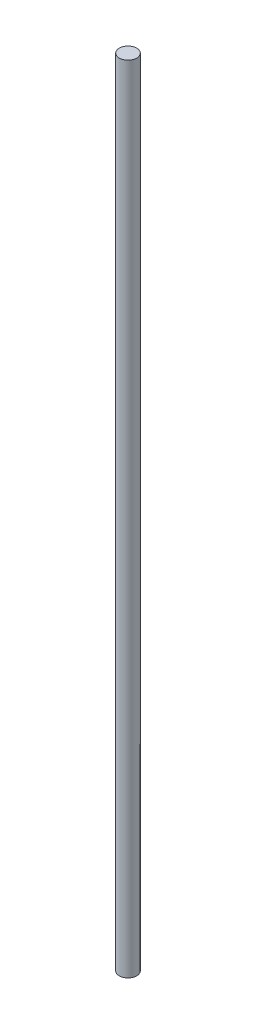
ISO-10303-21;
HEADER;
FILE_DESCRIPTION(('STEP AP214'),'2;1');
FILE_NAME('part.step','',(''),(''),'','','');
FILE_SCHEMA(('AUTOMOTIVE_DESIGN { 1 0 10303 214 1 1 1 1 }'));
ENDSEC;
DATA;
#1=APPLICATION_CONTEXT('core data for automotive mechanical design processes');
#2=APPLICATION_PROTOCOL_DEFINITION('international standard','automotive_design',2000,#1);
#3=PRODUCT_CONTEXT('',#1,'mechanical');
#4=PRODUCT('Part','Part','',(#3));
#5=PRODUCT_RELATED_PRODUCT_CATEGORY('part','',(#4));
#6=PRODUCT_DEFINITION_FORMATION('','',#4);
#7=PRODUCT_DEFINITION_CONTEXT('part definition',#1,'design');
#8=PRODUCT_DEFINITION('design','',#6,#7);
#9=PRODUCT_DEFINITION_SHAPE('','',#8);
#10=(LENGTH_UNIT() NAMED_UNIT(*) SI_UNIT(.MILLI.,.METRE.));
#11=(NAMED_UNIT(*) PLANE_ANGLE_UNIT() SI_UNIT($,.RADIAN.));
#12=(NAMED_UNIT(*) SI_UNIT($,.STERADIAN.) SOLID_ANGLE_UNIT());
#13=UNCERTAINTY_MEASURE_WITH_UNIT(LENGTH_MEASURE(1.E-05),#10,'distance_accuracy_value','');
#14=(GEOMETRIC_REPRESENTATION_CONTEXT(3) GLOBAL_UNCERTAINTY_ASSIGNED_CONTEXT((#13)) GLOBAL_UNIT_ASSIGNED_CONTEXT((#10,
#11,#12)) REPRESENTATION_CONTEXT('',''));
#15=CARTESIAN_POINT('',(0.,0.,0.));
#16=DIRECTION('',(0.,0.,1.));
#17=DIRECTION('',(1.,0.,0.));
#18=AXIS2_PLACEMENT_3D('',#15,#16,#17);
#19=CARTESIAN_POINT('',(0.,80.,0.));
#20=DIRECTION('',(0.,-1.,0.));
#21=DIRECTION('',(0.,0.,-1.));
#22=AXIS2_PLACEMENT_3D('',#19,#20,#21);
#23=CYLINDRICAL_SURFACE('',#22,0.875);
#24=CARTESIAN_POINT('',(0.,80.,0.));
#25=DIRECTION('',(0.,1.,0.));
#26=DIRECTION('',(0.,0.,1.));
#27=AXIS2_PLACEMENT_3D('',#24,#25,#26);
#28=CIRCLE('',#27,0.875);
#29=CARTESIAN_POINT('',(0.,80.,0.875));
#30=VERTEX_POINT('',#29);
#31=EDGE_CURVE('E10',#30,#30,#28,.T.);
#32=ORIENTED_EDGE('',*,*,#31,.F.);
#33=EDGE_LOOP('',(#32));
#34=FACE_BOUND('',#33,.T.);
#35=CARTESIAN_POINT('',(0.,0.,0.));
#36=DIRECTION('',(0.,1.,0.));
#37=DIRECTION('',(0.,0.,1.));
#38=AXIS2_PLACEMENT_3D('',#35,#36,#37);
#39=CIRCLE('',#38,0.875);
#40=CARTESIAN_POINT('',(0.,0.,0.875));
#41=VERTEX_POINT('',#40);
#42=EDGE_CURVE('E33',#41,#41,#39,.T.);
#43=ORIENTED_EDGE('',*,*,#42,.T.);
#44=EDGE_LOOP('',(#43));
#45=FACE_BOUND('',#44,.T.);
#46=ADVANCED_FACE('F30',(#34,#45),#23,.T.);
#47=CARTESIAN_POINT('',(0.,80.,0.));
#48=DIRECTION('',(0.,1.,0.));
#49=DIRECTION('',(0.,0.,1.));
#50=AXIS2_PLACEMENT_3D('',#47,#48,#49);
#51=PLANE('',#50);
#52=ORIENTED_EDGE('',*,*,#31,.T.);
#53=EDGE_LOOP('',(#52));
#54=FACE_BOUND('',#53,.T.);
#55=ADVANCED_FACE('F45',(#54),#51,.T.);
#56=CARTESIAN_POINT('',(0.,0.,0.));
#57=DIRECTION('',(0.,1.,0.));
#58=DIRECTION('',(0.,0.,1.));
#59=AXIS2_PLACEMENT_3D('',#56,#57,#58);
#60=PLANE('',#59);
#61=ORIENTED_EDGE('',*,*,#42,.F.);
#62=EDGE_LOOP('',(#61));
#63=FACE_BOUND('',#62,.T.);
#64=ADVANCED_FACE('F43',(#63),#60,.F.);
#65=CLOSED_SHELL('',(#46,#55,#64));
#66=MANIFOLD_SOLID_BREP('B2',#65);
#67=ADVANCED_BREP_SHAPE_REPRESENTATION('',(#18,#66),#14);
#68=SHAPE_DEFINITION_REPRESENTATION(#9,#67);
ENDSEC;
END-ISO-10303-21;
